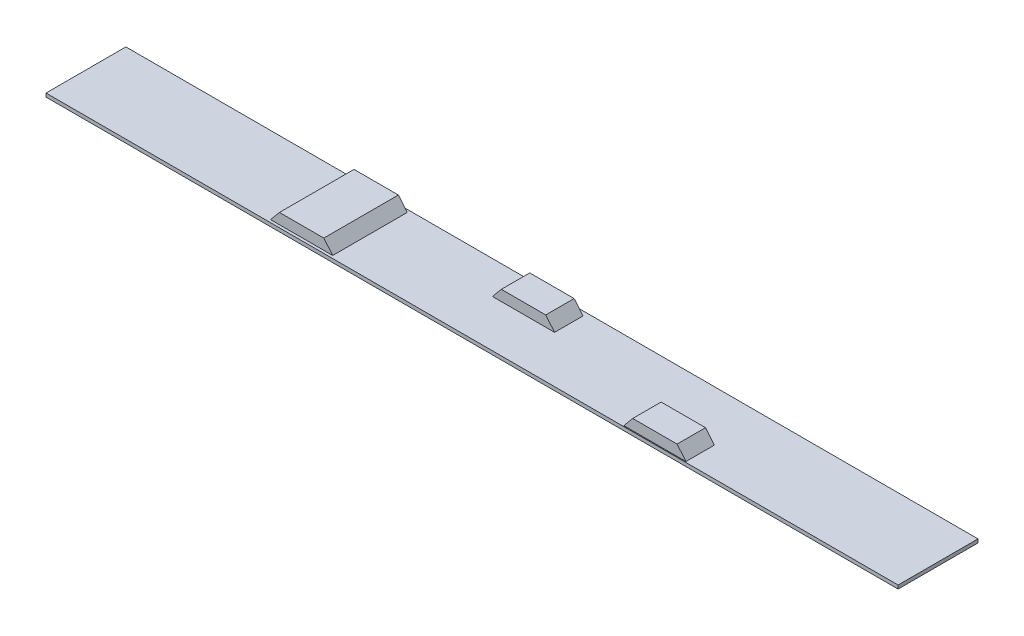
ISO-10303-21;
HEADER;
FILE_DESCRIPTION(('STEP AP214'),'2;1');
FILE_NAME('part.step','',(''),(''),'','','');
FILE_SCHEMA(('AUTOMOTIVE_DESIGN { 1 0 10303 214 1 1 1 1 }'));
ENDSEC;
DATA;
#1=APPLICATION_CONTEXT('core data for automotive mechanical design processes');
#2=APPLICATION_PROTOCOL_DEFINITION('international standard','automotive_design',2000,#1);
#3=PRODUCT_CONTEXT('',#1,'mechanical');
#4=PRODUCT('Part','Part','',(#3));
#5=PRODUCT_RELATED_PRODUCT_CATEGORY('part','',(#4));
#6=PRODUCT_DEFINITION_FORMATION('','',#4);
#7=PRODUCT_DEFINITION_CONTEXT('part definition',#1,'design');
#8=PRODUCT_DEFINITION('design','',#6,#7);
#9=PRODUCT_DEFINITION_SHAPE('','',#8);
#10=(LENGTH_UNIT() NAMED_UNIT(*) SI_UNIT(.MILLI.,.METRE.));
#11=(NAMED_UNIT(*) PLANE_ANGLE_UNIT() SI_UNIT($,.RADIAN.));
#12=(NAMED_UNIT(*) SI_UNIT($,.STERADIAN.) SOLID_ANGLE_UNIT());
#13=UNCERTAINTY_MEASURE_WITH_UNIT(LENGTH_MEASURE(1.E-05),#10,'distance_accuracy_value','');
#14=(GEOMETRIC_REPRESENTATION_CONTEXT(3) GLOBAL_UNCERTAINTY_ASSIGNED_CONTEXT((#13)) GLOBAL_UNIT_ASSIGNED_CONTEXT((#10,
#11,#12)) REPRESENTATION_CONTEXT('',''));
#15=CARTESIAN_POINT('',(0.,0.,0.));
#16=DIRECTION('',(0.,0.,1.));
#17=DIRECTION('',(1.,0.,0.));
#18=AXIS2_PLACEMENT_3D('',#15,#16,#17);
#19=CARTESIAN_POINT('',(0.,10.,0.));
#20=DIRECTION('',(0.,1.,0.));
#21=DIRECTION('',(0.,0.,1.));
#22=AXIS2_PLACEMENT_3D('',#19,#20,#21);
#23=PLANE('',#22);
#24=DIRECTION('',(1.,0.,0.));
#25=VECTOR('',#24,1.);
#26=CARTESIAN_POINT('',(99.9999999999993,10.,-100.));
#27=LINE('',#26,#25);
#28=CARTESIAN_POINT('',(-75.0000000000007,10.,-100.));
#29=VERTEX_POINT('',#28);
#30=CARTESIAN_POINT('',(99.9999999999993,10.,-100.));
#31=VERTEX_POINT('',#30);
#32=EDGE_CURVE('E183',#29,#31,#27,.T.);
#33=ORIENTED_EDGE('',*,*,#32,.T.);
#34=DIRECTION('',(0.,0.,1.));
#35=VECTOR('',#34,1.);
#36=CARTESIAN_POINT('',(99.9999999999993,10.,-100.));
#37=LINE('',#36,#35);
#38=CARTESIAN_POINT('',(99.9999999999993,10.,-20.));
#39=VERTEX_POINT('',#38);
#40=EDGE_CURVE('E208',#31,#39,#37,.T.);
#41=ORIENTED_EDGE('',*,*,#40,.T.);
#42=DIRECTION('',(1.,0.,0.));
#43=VECTOR('',#42,1.);
#44=CARTESIAN_POINT('',(99.9999999999993,10.,-20.));
#45=LINE('',#44,#43);
#46=CARTESIAN_POINT('',(-75.0000000000007,10.,-20.));
#47=VERTEX_POINT('',#46);
#48=EDGE_CURVE('E195',#47,#39,#45,.T.);
#49=ORIENTED_EDGE('',*,*,#48,.F.);
#50=DIRECTION('',(0.,0.,1.));
#51=VECTOR('',#50,1.);
#52=CARTESIAN_POINT('',(-75.0000000000007,10.,-100.));
#53=LINE('',#52,#51);
#54=EDGE_CURVE('E193',#29,#47,#53,.T.);
#55=ORIENTED_EDGE('',*,*,#54,.F.);
#56=EDGE_LOOP('',(#33,#41,#49,#55));
#57=FACE_BOUND('',#56,.T.);
#58=DIRECTION('',(0.,0.,-1.));
#59=VECTOR('',#58,1.);
#60=CARTESIAN_POINT('',(1200.,10.,-112.5));
#61=LINE('',#60,#59);
#62=CARTESIAN_POINT('',(1200.,10.,112.5));
#63=VERTEX_POINT('',#62);
#64=CARTESIAN_POINT('',(1200.,10.,-112.5));
#65=VERTEX_POINT('',#64);
#66=EDGE_CURVE('E243',#63,#65,#61,.T.);
#67=ORIENTED_EDGE('',*,*,#66,.T.);
#68=DIRECTION('',(-1.,0.,0.));
#69=VECTOR('',#68,1.);
#70=CARTESIAN_POINT('',(-1200.,10.,-112.5));
#71=LINE('',#70,#69);
#72=CARTESIAN_POINT('',(-1200.,10.,-112.5));
#73=VERTEX_POINT('',#72);
#74=EDGE_CURVE('E246',#65,#73,#71,.T.);
#75=ORIENTED_EDGE('',*,*,#74,.T.);
#76=DIRECTION('',(0.,0.,1.));
#77=VECTOR('',#76,1.);
#78=CARTESIAN_POINT('',(-1200.,10.,-112.5));
#79=LINE('',#78,#77);
#80=CARTESIAN_POINT('',(-1200.,10.,112.5));
#81=VERTEX_POINT('',#80);
#82=EDGE_CURVE('E249',#73,#81,#79,.T.);
#83=ORIENTED_EDGE('',*,*,#82,.T.);
#84=DIRECTION('',(1.,0.,0.));
#85=VECTOR('',#84,1.);
#86=CARTESIAN_POINT('',(-1200.,10.,112.5));
#87=LINE('',#86,#85);
#88=EDGE_CURVE('E251',#81,#63,#87,.T.);
#89=ORIENTED_EDGE('',*,*,#88,.T.);
#90=EDGE_LOOP('',(#67,#75,#83,#89));
#91=FACE_BOUND('',#90,.T.);
#92=DIRECTION('',(0.,0.,-1.));
#93=VECTOR('',#92,1.);
#94=CARTESIAN_POINT('',(599.999999999999,10.,110.));
#95=LINE('',#94,#93);
#96=CARTESIAN_POINT('',(599.999999999999,10.,110.));
#97=VERTEX_POINT('',#96);
#98=CARTESIAN_POINT('',(599.999999999999,10.,30.));
#99=VERTEX_POINT('',#98);
#100=EDGE_CURVE('E239',#97,#99,#95,.T.);
#101=ORIENTED_EDGE('',*,*,#100,.F.);
#102=DIRECTION('',(1.,0.,0.));
#103=VECTOR('',#102,1.);
#104=CARTESIAN_POINT('',(599.999999999999,10.,110.));
#105=LINE('',#104,#103);
#106=CARTESIAN_POINT('',(424.999999999999,10.,110.));
#107=VERTEX_POINT('',#106);
#108=EDGE_CURVE('E213',#107,#97,#105,.T.);
#109=ORIENTED_EDGE('',*,*,#108,.F.);
#110=DIRECTION('',(0.,0.,-1.));
#111=VECTOR('',#110,1.);
#112=CARTESIAN_POINT('',(424.999999999999,10.,110.));
#113=LINE('',#112,#111);
#114=CARTESIAN_POINT('',(424.999999999999,10.,30.));
#115=VERTEX_POINT('',#114);
#116=EDGE_CURVE('E224',#107,#115,#113,.T.);
#117=ORIENTED_EDGE('',*,*,#116,.T.);
#118=DIRECTION('',(1.,0.,0.));
#119=VECTOR('',#118,1.);
#120=CARTESIAN_POINT('',(599.999999999999,10.,30.));
#121=LINE('',#120,#119);
#122=EDGE_CURVE('E205',#115,#99,#121,.T.);
#123=ORIENTED_EDGE('',*,*,#122,.T.);
#124=EDGE_LOOP('',(#101,#109,#117,#123));
#125=FACE_BOUND('',#124,.T.);
#126=DIRECTION('',(0.,0.,-1.));
#127=VECTOR('',#126,1.);
#128=CARTESIAN_POINT('',(-400.000000000001,9.99999999999302,105.));
#129=LINE('',#128,#127);
#130=CARTESIAN_POINT('',(-400.000000000007,10.,105.));
#131=VERTEX_POINT('',#130);
#132=CARTESIAN_POINT('',(-400.000000000001,10.,-105.));
#133=VERTEX_POINT('',#132);
#134=EDGE_CURVE('E53',#131,#133,#129,.T.);
#135=ORIENTED_EDGE('',*,*,#134,.F.);
#136=DIRECTION('',(1.,0.,0.));
#137=VECTOR('',#136,1.);
#138=CARTESIAN_POINT('',(-400.000000000001,9.99999999999302,105.));
#139=LINE('',#138,#137);
#140=CARTESIAN_POINT('',(-574.999999999995,10.,105.));
#141=VERTEX_POINT('',#140);
#142=EDGE_CURVE('E48',#141,#131,#139,.T.);
#143=ORIENTED_EDGE('',*,*,#142,.F.);
#144=DIRECTION('',(0.,0.,-1.));
#145=VECTOR('',#144,1.);
#146=CARTESIAN_POINT('',(-575.000000000001,9.99999999999302,105.));
#147=LINE('',#146,#145);
#148=CARTESIAN_POINT('',(-575.000000000001,9.99999999999302,-105.));
#149=VERTEX_POINT('',#148);
#150=EDGE_CURVE('E177',#141,#149,#147,.T.);
#151=ORIENTED_EDGE('',*,*,#150,.T.);
#152=DIRECTION('',(1.,0.,0.));
#153=VECTOR('',#152,1.);
#154=CARTESIAN_POINT('',(-400.000000000001,9.99999999999302,-105.));
#155=LINE('',#154,#153);
#156=EDGE_CURVE('E170',#149,#133,#155,.T.);
#157=ORIENTED_EDGE('',*,*,#156,.T.);
#158=EDGE_LOOP('',(#135,#143,#151,#157));
#159=FACE_BOUND('',#158,.T.);
#160=ADVANCED_FACE('F33',(#57,#91,#125,#159),#23,.T.);
#161=CARTESIAN_POINT('',(1200.,10.,-112.5));
#162=DIRECTION('',(-1.,0.,0.));
#163=DIRECTION('',(0.,0.,1.));
#164=AXIS2_PLACEMENT_3D('',#161,#162,#163);
#165=PLANE('',#164);
#166=DIRECTION('',(0.,0.,-1.));
#167=VECTOR('',#166,1.);
#168=CARTESIAN_POINT('',(1200.,0.,-112.5));
#169=LINE('',#168,#167);
#170=CARTESIAN_POINT('',(1200.,0.,112.5));
#171=VERTEX_POINT('',#170);
#172=CARTESIAN_POINT('',(1200.,0.,-112.5));
#173=VERTEX_POINT('',#172);
#174=EDGE_CURVE('E242',#171,#173,#169,.T.);
#175=ORIENTED_EDGE('',*,*,#174,.T.);
#176=DIRECTION('',(0.,-1.,0.));
#177=VECTOR('',#176,1.);
#178=CARTESIAN_POINT('',(1200.,10.,-112.5));
#179=LINE('',#178,#177);
#180=EDGE_CURVE('E11',#65,#173,#179,.T.);
#181=ORIENTED_EDGE('',*,*,#180,.F.);
#182=ORIENTED_EDGE('',*,*,#66,.F.);
#183=DIRECTION('',(0.,-1.,0.));
#184=VECTOR('',#183,1.);
#185=CARTESIAN_POINT('',(1200.,10.,112.5));
#186=LINE('',#185,#184);
#187=EDGE_CURVE('E253',#63,#171,#186,.T.);
#188=ORIENTED_EDGE('',*,*,#187,.T.);
#189=EDGE_LOOP('',(#175,#181,#182,#188));
#190=FACE_BOUND('',#189,.T.);
#191=ADVANCED_FACE('F35',(#190),#165,.F.);
#192=CARTESIAN_POINT('',(-1200.,10.,-112.5));
#193=DIRECTION('',(0.,0.,1.));
#194=DIRECTION('',(1.,0.,0.));
#195=AXIS2_PLACEMENT_3D('',#192,#193,#194);
#196=PLANE('',#195);
#197=DIRECTION('',(-1.,0.,0.));
#198=VECTOR('',#197,1.);
#199=CARTESIAN_POINT('',(-1200.,0.,-112.5));
#200=LINE('',#199,#198);
#201=CARTESIAN_POINT('',(-1200.,0.,-112.5));
#202=VERTEX_POINT('',#201);
#203=EDGE_CURVE('E256',#173,#202,#200,.T.);
#204=ORIENTED_EDGE('',*,*,#203,.T.);
#205=DIRECTION('',(0.,-1.,0.));
#206=VECTOR('',#205,1.);
#207=CARTESIAN_POINT('',(-1200.,10.,-112.5));
#208=LINE('',#207,#206);
#209=EDGE_CURVE('E41',#73,#202,#208,.T.);
#210=ORIENTED_EDGE('',*,*,#209,.F.);
#211=ORIENTED_EDGE('',*,*,#74,.F.);
#212=ORIENTED_EDGE('',*,*,#180,.T.);
#213=EDGE_LOOP('',(#204,#210,#211,#212));
#214=FACE_BOUND('',#213,.T.);
#215=ADVANCED_FACE('F286',(#214),#196,.F.);
#216=CARTESIAN_POINT('',(-1200.,10.,-112.5));
#217=DIRECTION('',(1.,0.,0.));
#218=DIRECTION('',(0.,0.,-1.));
#219=AXIS2_PLACEMENT_3D('',#216,#217,#218);
#220=PLANE('',#219);
#221=DIRECTION('',(0.,0.,1.));
#222=VECTOR('',#221,1.);
#223=CARTESIAN_POINT('',(-1200.,0.,-112.5));
#224=LINE('',#223,#222);
#225=CARTESIAN_POINT('',(-1200.,0.,112.5));
#226=VERTEX_POINT('',#225);
#227=EDGE_CURVE('E258',#202,#226,#224,.T.);
#228=ORIENTED_EDGE('',*,*,#227,.T.);
#229=DIRECTION('',(0.,-1.,0.));
#230=VECTOR('',#229,1.);
#231=CARTESIAN_POINT('',(-1200.,10.,112.5));
#232=LINE('',#231,#230);
#233=EDGE_CURVE('E263',#81,#226,#232,.T.);
#234=ORIENTED_EDGE('',*,*,#233,.F.);
#235=ORIENTED_EDGE('',*,*,#82,.F.);
#236=ORIENTED_EDGE('',*,*,#209,.T.);
#237=EDGE_LOOP('',(#228,#234,#235,#236));
#238=FACE_BOUND('',#237,.T.);
#239=ADVANCED_FACE('F270',(#238),#220,.F.);
#240=CARTESIAN_POINT('',(-1200.,10.,112.5));
#241=DIRECTION('',(0.,0.,-1.));
#242=DIRECTION('',(-1.,0.,0.));
#243=AXIS2_PLACEMENT_3D('',#240,#241,#242);
#244=PLANE('',#243);
#245=DIRECTION('',(1.,0.,0.));
#246=VECTOR('',#245,1.);
#247=CARTESIAN_POINT('',(-1200.,0.,112.5));
#248=LINE('',#247,#246);
#249=EDGE_CURVE('E247',#226,#171,#248,.T.);
#250=ORIENTED_EDGE('',*,*,#249,.T.);
#251=ORIENTED_EDGE('',*,*,#187,.F.);
#252=ORIENTED_EDGE('',*,*,#88,.F.);
#253=ORIENTED_EDGE('',*,*,#233,.T.);
#254=EDGE_LOOP('',(#250,#251,#252,#253));
#255=FACE_BOUND('',#254,.T.);
#256=ADVANCED_FACE('F279',(#255),#244,.F.);
#257=CARTESIAN_POINT('',(0.,0.,0.));
#258=DIRECTION('',(0.,1.,0.));
#259=DIRECTION('',(0.,0.,1.));
#260=AXIS2_PLACEMENT_3D('',#257,#258,#259);
#261=PLANE('',#260);
#262=ORIENTED_EDGE('',*,*,#174,.F.);
#263=ORIENTED_EDGE('',*,*,#249,.F.);
#264=ORIENTED_EDGE('',*,*,#227,.F.);
#265=ORIENTED_EDGE('',*,*,#203,.F.);
#266=EDGE_LOOP('',(#262,#263,#264,#265));
#267=FACE_BOUND('',#266,.T.);
#268=ADVANCED_FACE('F276',(#267),#261,.F.);
#269=CARTESIAN_POINT('',(574.999999999999,40.,110.));
#270=DIRECTION('',(-0.768221279597374,-0.640184399664482,0.));
#271=DIRECTION('',(0.640184399664482,-0.768221279597374,0.));
#272=AXIS2_PLACEMENT_3D('',#269,#270,#271);
#273=PLANE('',#272);
#274=DIRECTION('',(-0.640184399664482,0.768221279597374,0.));
#275=VECTOR('',#274,1.);
#276=CARTESIAN_POINT('',(574.999999999999,40.,30.));
#277=LINE('',#276,#275);
#278=CARTESIAN_POINT('',(574.999999999999,40.,30.));
#279=VERTEX_POINT('',#278);
#280=EDGE_CURVE('E226',#99,#279,#277,.T.);
#281=ORIENTED_EDGE('',*,*,#280,.T.);
#282=DIRECTION('',(0.,0.,-1.));
#283=VECTOR('',#282,1.);
#284=CARTESIAN_POINT('',(574.999999999999,40.,110.));
#285=LINE('',#284,#283);
#286=CARTESIAN_POINT('',(574.999999999999,40.,110.));
#287=VERTEX_POINT('',#286);
#288=EDGE_CURVE('E236',#287,#279,#285,.T.);
#289=ORIENTED_EDGE('',*,*,#288,.F.);
#290=DIRECTION('',(-0.640184399664482,0.768221279597374,0.));
#291=VECTOR('',#290,1.);
#292=CARTESIAN_POINT('',(574.999999999999,40.,110.));
#293=LINE('',#292,#291);
#294=EDGE_CURVE('E216',#97,#287,#293,.T.);
#295=ORIENTED_EDGE('',*,*,#294,.F.);
#296=ORIENTED_EDGE('',*,*,#100,.T.);
#297=EDGE_LOOP('',(#281,#289,#295,#296));
#298=FACE_BOUND('',#297,.T.);
#299=ADVANCED_FACE('F300',(#298),#273,.F.);
#300=CARTESIAN_POINT('',(449.999999999999,40.,110.));
#301=DIRECTION('',(0.,-1.,0.));
#302=DIRECTION('',(0.,0.,-1.));
#303=AXIS2_PLACEMENT_3D('',#300,#301,#302);
#304=PLANE('',#303);
#305=DIRECTION('',(-1.,0.,0.));
#306=VECTOR('',#305,1.);
#307=CARTESIAN_POINT('',(449.999999999999,40.,30.));
#308=LINE('',#307,#306);
#309=CARTESIAN_POINT('',(449.999999999999,40.,30.));
#310=VERTEX_POINT('',#309);
#311=EDGE_CURVE('E228',#279,#310,#308,.T.);
#312=ORIENTED_EDGE('',*,*,#311,.T.);
#313=DIRECTION('',(0.,0.,-1.));
#314=VECTOR('',#313,1.);
#315=CARTESIAN_POINT('',(449.999999999999,40.,110.));
#316=LINE('',#315,#314);
#317=CARTESIAN_POINT('',(449.999999999999,40.,110.));
#318=VERTEX_POINT('',#317);
#319=EDGE_CURVE('E233',#318,#310,#316,.T.);
#320=ORIENTED_EDGE('',*,*,#319,.F.);
#321=DIRECTION('',(-1.,0.,0.));
#322=VECTOR('',#321,1.);
#323=CARTESIAN_POINT('',(449.999999999999,40.,110.));
#324=LINE('',#323,#322);
#325=EDGE_CURVE('E219',#287,#318,#324,.T.);
#326=ORIENTED_EDGE('',*,*,#325,.F.);
#327=ORIENTED_EDGE('',*,*,#288,.T.);
#328=EDGE_LOOP('',(#312,#320,#326,#327));
#329=FACE_BOUND('',#328,.T.);
#330=ADVANCED_FACE('F319',(#329),#304,.F.);
#331=CARTESIAN_POINT('',(424.999999999999,10.,110.));
#332=DIRECTION('',(0.768221279597377,-0.640184399664478,0.));
#333=DIRECTION('',(0.640184399664478,0.768221279597377,0.));
#334=AXIS2_PLACEMENT_3D('',#331,#332,#333);
#335=PLANE('',#334);
#336=DIRECTION('',(-0.640184399664478,-0.768221279597377,0.));
#337=VECTOR('',#336,1.);
#338=CARTESIAN_POINT('',(424.999999999999,10.,30.));
#339=LINE('',#338,#337);
#340=EDGE_CURVE('E217',#310,#115,#339,.T.);
#341=ORIENTED_EDGE('',*,*,#340,.T.);
#342=ORIENTED_EDGE('',*,*,#116,.F.);
#343=DIRECTION('',(-0.640184399664478,-0.768221279597377,0.));
#344=VECTOR('',#343,1.);
#345=CARTESIAN_POINT('',(424.999999999999,10.,110.));
#346=LINE('',#345,#344);
#347=EDGE_CURVE('E221',#318,#107,#346,.T.);
#348=ORIENTED_EDGE('',*,*,#347,.F.);
#349=ORIENTED_EDGE('',*,*,#319,.T.);
#350=EDGE_LOOP('',(#341,#342,#348,#349));
#351=FACE_BOUND('',#350,.T.);
#352=ADVANCED_FACE('F326',(#351),#335,.F.);
#353=CARTESIAN_POINT('',(0.,0.,110.));
#354=DIRECTION('',(0.,0.,-1.));
#355=DIRECTION('',(-1.,0.,0.));
#356=AXIS2_PLACEMENT_3D('',#353,#354,#355);
#357=PLANE('',#356);
#358=ORIENTED_EDGE('',*,*,#108,.T.);
#359=ORIENTED_EDGE('',*,*,#294,.T.);
#360=ORIENTED_EDGE('',*,*,#325,.T.);
#361=ORIENTED_EDGE('',*,*,#347,.T.);
#362=EDGE_LOOP('',(#358,#359,#360,#361));
#363=FACE_BOUND('',#362,.T.);
#364=ADVANCED_FACE('F333',(#363),#357,.F.);
#365=CARTESIAN_POINT('',(0.,0.,30.));
#366=DIRECTION('',(0.,0.,-1.));
#367=DIRECTION('',(-1.,0.,0.));
#368=AXIS2_PLACEMENT_3D('',#365,#366,#367);
#369=PLANE('',#368);
#370=ORIENTED_EDGE('',*,*,#122,.F.);
#371=ORIENTED_EDGE('',*,*,#340,.F.);
#372=ORIENTED_EDGE('',*,*,#311,.F.);
#373=ORIENTED_EDGE('',*,*,#280,.F.);
#374=EDGE_LOOP('',(#370,#371,#372,#373));
#375=FACE_BOUND('',#374,.T.);
#376=ADVANCED_FACE('F341',(#375),#369,.T.);
#377=CARTESIAN_POINT('',(-75.0000000000007,10.,-100.));
#378=DIRECTION('',(-0.768221279597377,0.640184399664478,0.));
#379=DIRECTION('',(-0.640184399664478,-0.768221279597377,0.));
#380=AXIS2_PLACEMENT_3D('',#377,#378,#379);
#381=PLANE('',#380);
#382=DIRECTION('',(-0.640184399664478,-0.768221279597377,0.));
#383=VECTOR('',#382,1.);
#384=CARTESIAN_POINT('',(-75.0000000000007,10.,-20.));
#385=LINE('',#384,#383);
#386=CARTESIAN_POINT('',(-50.0000000000008,40.,-20.));
#387=VERTEX_POINT('',#386);
#388=EDGE_CURVE('E179',#387,#47,#385,.T.);
#389=ORIENTED_EDGE('',*,*,#388,.F.);
#390=DIRECTION('',(0.,0.,1.));
#391=VECTOR('',#390,1.);
#392=CARTESIAN_POINT('',(-50.0000000000008,40.,-100.));
#393=LINE('',#392,#391);
#394=CARTESIAN_POINT('',(-50.0000000000008,40.,-100.));
#395=VERTEX_POINT('',#394);
#396=EDGE_CURVE('E203',#395,#387,#393,.T.);
#397=ORIENTED_EDGE('',*,*,#396,.F.);
#398=DIRECTION('',(-0.640184399664478,-0.768221279597377,0.));
#399=VECTOR('',#398,1.);
#400=CARTESIAN_POINT('',(-75.0000000000007,10.,-100.));
#401=LINE('',#400,#399);
#402=EDGE_CURVE('E180',#395,#29,#401,.T.);
#403=ORIENTED_EDGE('',*,*,#402,.T.);
#404=ORIENTED_EDGE('',*,*,#54,.T.);
#405=EDGE_LOOP('',(#389,#397,#403,#404));
#406=FACE_BOUND('',#405,.T.);
#407=ADVANCED_FACE('F349',(#406),#381,.T.);
#408=CARTESIAN_POINT('',(-50.0000000000008,40.,-100.));
#409=DIRECTION('',(0.,1.,0.));
#410=DIRECTION('',(0.,0.,1.));
#411=AXIS2_PLACEMENT_3D('',#408,#409,#410);
#412=PLANE('',#411);
#413=DIRECTION('',(-1.,0.,0.));
#414=VECTOR('',#413,1.);
#415=CARTESIAN_POINT('',(-50.0000000000008,40.,-20.));
#416=LINE('',#415,#414);
#417=CARTESIAN_POINT('',(74.9999999999992,40.,-20.));
#418=VERTEX_POINT('',#417);
#419=EDGE_CURVE('E184',#418,#387,#416,.T.);
#420=ORIENTED_EDGE('',*,*,#419,.F.);
#421=DIRECTION('',(0.,0.,1.));
#422=VECTOR('',#421,1.);
#423=CARTESIAN_POINT('',(74.9999999999992,40.,-100.));
#424=LINE('',#423,#422);
#425=CARTESIAN_POINT('',(74.9999999999992,40.,-100.));
#426=VERTEX_POINT('',#425);
#427=EDGE_CURVE('E206',#426,#418,#424,.T.);
#428=ORIENTED_EDGE('',*,*,#427,.F.);
#429=DIRECTION('',(-1.,0.,0.));
#430=VECTOR('',#429,1.);
#431=CARTESIAN_POINT('',(-50.0000000000008,40.,-100.));
#432=LINE('',#431,#430);
#433=EDGE_CURVE('E190',#426,#395,#432,.T.);
#434=ORIENTED_EDGE('',*,*,#433,.T.);
#435=ORIENTED_EDGE('',*,*,#396,.T.);
#436=EDGE_LOOP('',(#420,#428,#434,#435));
#437=FACE_BOUND('',#436,.T.);
#438=ADVANCED_FACE('F357',(#437),#412,.T.);
#439=CARTESIAN_POINT('',(74.9999999999992,40.,-100.));
#440=DIRECTION('',(0.768221279597374,0.640184399664482,0.));
#441=DIRECTION('',(-0.640184399664482,0.768221279597374,0.));
#442=AXIS2_PLACEMENT_3D('',#439,#440,#441);
#443=PLANE('',#442);
#444=DIRECTION('',(-0.640184399664482,0.768221279597374,0.));
#445=VECTOR('',#444,1.);
#446=CARTESIAN_POINT('',(74.9999999999992,40.,-20.));
#447=LINE('',#446,#445);
#448=EDGE_CURVE('E198',#39,#418,#447,.T.);
#449=ORIENTED_EDGE('',*,*,#448,.F.);
#450=ORIENTED_EDGE('',*,*,#40,.F.);
#451=DIRECTION('',(-0.640184399664482,0.768221279597374,0.));
#452=VECTOR('',#451,1.);
#453=CARTESIAN_POINT('',(74.9999999999992,40.,-100.));
#454=LINE('',#453,#452);
#455=EDGE_CURVE('E187',#31,#426,#454,.T.);
#456=ORIENTED_EDGE('',*,*,#455,.T.);
#457=ORIENTED_EDGE('',*,*,#427,.T.);
#458=EDGE_LOOP('',(#449,#450,#456,#457));
#459=FACE_BOUND('',#458,.T.);
#460=ADVANCED_FACE('F365',(#459),#443,.T.);
#461=CARTESIAN_POINT('',(0.,0.,-100.));
#462=DIRECTION('',(0.,0.,-1.));
#463=DIRECTION('',(-1.,0.,0.));
#464=AXIS2_PLACEMENT_3D('',#461,#462,#463);
#465=PLANE('',#464);
#466=ORIENTED_EDGE('',*,*,#402,.F.);
#467=ORIENTED_EDGE('',*,*,#433,.F.);
#468=ORIENTED_EDGE('',*,*,#455,.F.);
#469=ORIENTED_EDGE('',*,*,#32,.F.);
#470=EDGE_LOOP('',(#466,#467,#468,#469));
#471=FACE_BOUND('',#470,.T.);
#472=ADVANCED_FACE('F373',(#471),#465,.T.);
#473=CARTESIAN_POINT('',(0.,0.,-20.));
#474=DIRECTION('',(0.,0.,-1.));
#475=DIRECTION('',(-1.,0.,0.));
#476=AXIS2_PLACEMENT_3D('',#473,#474,#475);
#477=PLANE('',#476);
#478=ORIENTED_EDGE('',*,*,#388,.T.);
#479=ORIENTED_EDGE('',*,*,#48,.T.);
#480=ORIENTED_EDGE('',*,*,#448,.T.);
#481=ORIENTED_EDGE('',*,*,#419,.T.);
#482=EDGE_LOOP('',(#478,#479,#480,#481));
#483=FACE_BOUND('',#482,.T.);
#484=ADVANCED_FACE('F381',(#483),#477,.F.);
#485=CARTESIAN_POINT('',(-575.000000000001,9.99999999999302,105.));
#486=DIRECTION('',(0.768221279597377,-0.640184399664478,0.));
#487=DIRECTION('',(0.640184399664479,0.768221279597377,0.));
#488=AXIS2_PLACEMENT_3D('',#485,#486,#487);
#489=PLANE('',#488);
#490=DIRECTION('',(-0.640184399664478,-0.768221279597377,0.));
#491=VECTOR('',#490,1.);
#492=CARTESIAN_POINT('',(-575.000000000001,9.99999999999302,-105.));
#493=LINE('',#492,#491);
#494=CARTESIAN_POINT('',(-550.000000000001,39.999999999993,-105.));
#495=VERTEX_POINT('',#494);
#496=EDGE_CURVE('E167',#495,#149,#493,.T.);
#497=ORIENTED_EDGE('',*,*,#496,.T.);
#498=ORIENTED_EDGE('',*,*,#150,.F.);
#499=DIRECTION('',(-0.640184399664478,-0.768221279597377,0.));
#500=VECTOR('',#499,1.);
#501=CARTESIAN_POINT('',(-575.000000000001,9.99999999999302,105.));
#502=LINE('',#501,#500);
#503=CARTESIAN_POINT('',(-550.000000000001,39.999999999993,105.));
#504=VERTEX_POINT('',#503);
#505=EDGE_CURVE('E174',#504,#141,#502,.T.);
#506=ORIENTED_EDGE('',*,*,#505,.F.);
#507=DIRECTION('',(0.,0.,-1.));
#508=VECTOR('',#507,1.);
#509=CARTESIAN_POINT('',(-550.000000000001,39.999999999993,105.));
#510=LINE('',#509,#508);
#511=EDGE_CURVE('E158',#504,#495,#510,.T.);
#512=ORIENTED_EDGE('',*,*,#511,.T.);
#513=EDGE_LOOP('',(#497,#498,#506,#512));
#514=FACE_BOUND('',#513,.T.);
#515=ADVANCED_FACE('F389',(#514),#489,.F.);
#516=CARTESIAN_POINT('',(-425.000000000001,39.999999999993,105.));
#517=DIRECTION('',(-0.768221279597374,-0.640184399664482,0.));
#518=DIRECTION('',(0.640184399664482,-0.768221279597374,0.));
#519=AXIS2_PLACEMENT_3D('',#516,#517,#518);
#520=PLANE('',#519);
#521=DIRECTION('',(-0.640184399664482,0.768221279597374,0.));
#522=VECTOR('',#521,1.);
#523=CARTESIAN_POINT('',(-425.000000000001,39.999999999993,-105.));
#524=LINE('',#523,#522);
#525=CARTESIAN_POINT('',(-425.000000000001,39.999999999993,-105.));
#526=VERTEX_POINT('',#525);
#527=EDGE_CURVE('E155',#133,#526,#524,.T.);
#528=ORIENTED_EDGE('',*,*,#527,.T.);
#529=DIRECTION('',(0.,0.,-1.));
#530=VECTOR('',#529,1.);
#531=CARTESIAN_POINT('',(-425.000000000001,39.999999999993,105.));
#532=LINE('',#531,#530);
#533=CARTESIAN_POINT('',(-425.000000000001,39.999999999993,105.));
#534=VERTEX_POINT('',#533);
#535=EDGE_CURVE('E152',#534,#526,#532,.T.);
#536=ORIENTED_EDGE('',*,*,#535,.F.);
#537=DIRECTION('',(-0.640184399664482,0.768221279597374,0.));
#538=VECTOR('',#537,1.);
#539=CARTESIAN_POINT('',(-425.000000000001,39.999999999993,105.));
#540=LINE('',#539,#538);
#541=EDGE_CURVE('E143',#131,#534,#540,.T.);
#542=ORIENTED_EDGE('',*,*,#541,.F.);
#543=ORIENTED_EDGE('',*,*,#134,.T.);
#544=EDGE_LOOP('',(#528,#536,#542,#543));
#545=FACE_BOUND('',#544,.T.);
#546=ADVANCED_FACE('F153',(#545),#520,.F.);
#547=CARTESIAN_POINT('',(-550.000000000001,39.999999999993,105.));
#548=DIRECTION('',(0.,-1.,0.));
#549=DIRECTION('',(0.,0.,-1.));
#550=AXIS2_PLACEMENT_3D('',#547,#548,#549);
#551=PLANE('',#550);
#552=DIRECTION('',(-1.,0.,0.));
#553=VECTOR('',#552,1.);
#554=CARTESIAN_POINT('',(-550.000000000001,39.999999999993,-105.));
#555=LINE('',#554,#553);
#556=EDGE_CURVE('E173',#526,#495,#555,.T.);
#557=ORIENTED_EDGE('',*,*,#556,.T.);
#558=ORIENTED_EDGE('',*,*,#511,.F.);
#559=DIRECTION('',(-1.,0.,0.));
#560=VECTOR('',#559,1.);
#561=CARTESIAN_POINT('',(-550.000000000001,39.999999999993,105.));
#562=LINE('',#561,#560);
#563=EDGE_CURVE('E147',#534,#504,#562,.T.);
#564=ORIENTED_EDGE('',*,*,#563,.F.);
#565=ORIENTED_EDGE('',*,*,#535,.T.);
#566=EDGE_LOOP('',(#557,#558,#564,#565));
#567=FACE_BOUND('',#566,.T.);
#568=ADVANCED_FACE('F160',(#567),#551,.F.);
#569=CARTESIAN_POINT('',(0.,0.,105.));
#570=DIRECTION('',(0.,0.,-1.));
#571=DIRECTION('',(-1.,0.,0.));
#572=AXIS2_PLACEMENT_3D('',#569,#570,#571);
#573=PLANE('',#572);
#574=ORIENTED_EDGE('',*,*,#505,.T.);
#575=ORIENTED_EDGE('',*,*,#142,.T.);
#576=ORIENTED_EDGE('',*,*,#541,.T.);
#577=ORIENTED_EDGE('',*,*,#563,.T.);
#578=EDGE_LOOP('',(#574,#575,#576,#577));
#579=FACE_BOUND('',#578,.T.);
#580=ADVANCED_FACE('F145',(#579),#573,.F.);
#581=CARTESIAN_POINT('',(0.,0.,-105.));
#582=DIRECTION('',(0.,0.,-1.));
#583=DIRECTION('',(-1.,0.,0.));
#584=AXIS2_PLACEMENT_3D('',#581,#582,#583);
#585=PLANE('',#584);
#586=ORIENTED_EDGE('',*,*,#496,.F.);
#587=ORIENTED_EDGE('',*,*,#556,.F.);
#588=ORIENTED_EDGE('',*,*,#527,.F.);
#589=ORIENTED_EDGE('',*,*,#156,.F.);
#590=EDGE_LOOP('',(#586,#587,#588,#589));
#591=FACE_BOUND('',#590,.T.);
#592=ADVANCED_FACE('F416',(#591),#585,.T.);
#593=CLOSED_SHELL('',(#160,#191,#215,#239,#256,#268,#299,#330,#352,#364,#376,#407,#438,#460,
#472,#484,#515,#546,#568,#580,#592));
#594=MANIFOLD_SOLID_BREP('B2',#593);
#595=ADVANCED_BREP_SHAPE_REPRESENTATION('',(#18,#594),#14);
#596=SHAPE_DEFINITION_REPRESENTATION(#9,#595);
ENDSEC;
END-ISO-10303-21;
